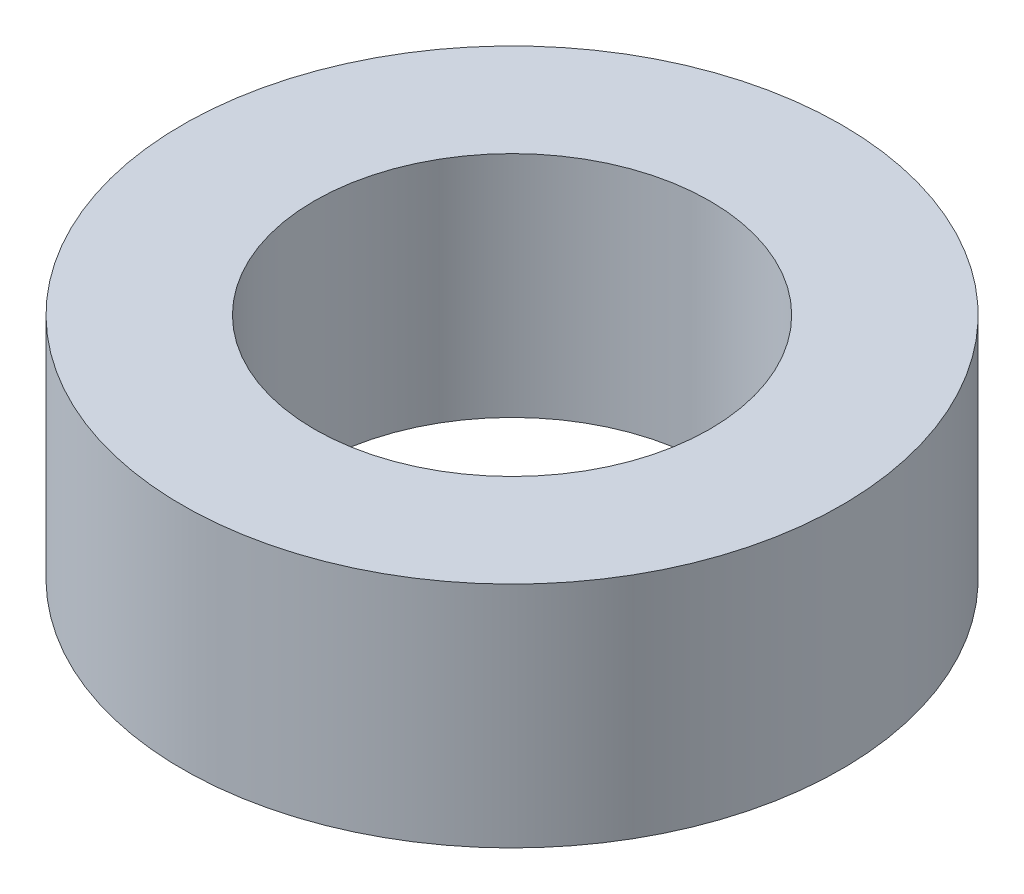
ISO-10303-21;
HEADER;
FILE_DESCRIPTION(('STEP AP214'),'2;1');
FILE_NAME('part.step','',(''),(''),'','','');
FILE_SCHEMA(('AUTOMOTIVE_DESIGN { 1 0 10303 214 1 1 1 1 }'));
ENDSEC;
DATA;
#1=APPLICATION_CONTEXT('core data for automotive mechanical design processes');
#2=APPLICATION_PROTOCOL_DEFINITION('international standard','automotive_design',2000,#1);
#3=PRODUCT_CONTEXT('',#1,'mechanical');
#4=PRODUCT('Part','Part','',(#3));
#5=PRODUCT_RELATED_PRODUCT_CATEGORY('part','',(#4));
#6=PRODUCT_DEFINITION_FORMATION('','',#4);
#7=PRODUCT_DEFINITION_CONTEXT('part definition',#1,'design');
#8=PRODUCT_DEFINITION('design','',#6,#7);
#9=PRODUCT_DEFINITION_SHAPE('','',#8);
#10=(LENGTH_UNIT() NAMED_UNIT(*) SI_UNIT(.MILLI.,.METRE.));
#11=(NAMED_UNIT(*) PLANE_ANGLE_UNIT() SI_UNIT($,.RADIAN.));
#12=(NAMED_UNIT(*) SI_UNIT($,.STERADIAN.) SOLID_ANGLE_UNIT());
#13=UNCERTAINTY_MEASURE_WITH_UNIT(LENGTH_MEASURE(1.E-05),#10,'distance_accuracy_value','');
#14=(GEOMETRIC_REPRESENTATION_CONTEXT(3) GLOBAL_UNCERTAINTY_ASSIGNED_CONTEXT((#13)) GLOBAL_UNIT_ASSIGNED_CONTEXT((#10,
#11,#12)) REPRESENTATION_CONTEXT('',''));
#15=CARTESIAN_POINT('',(0.,0.,0.));
#16=DIRECTION('',(0.,0.,1.));
#17=DIRECTION('',(1.,0.,0.));
#18=AXIS2_PLACEMENT_3D('',#15,#16,#17);
#19=CARTESIAN_POINT('',(0.,26.,0.));
#20=DIRECTION('',(0.,-1.,0.));
#21=DIRECTION('',(0.,0.,-1.));
#22=AXIS2_PLACEMENT_3D('',#19,#20,#21);
#23=CYLINDRICAL_SURFACE('',#22,37.5);
#24=CARTESIAN_POINT('',(0.,26.,0.));
#25=DIRECTION('',(0.,1.,0.));
#26=DIRECTION('',(0.,0.,1.));
#27=AXIS2_PLACEMENT_3D('',#24,#25,#26);
#28=CIRCLE('',#27,37.5);
#29=CARTESIAN_POINT('',(0.,26.,-37.5));
#30=VERTEX_POINT('',#29);
#31=EDGE_CURVE('E10',#30,#30,#28,.T.);
#32=CARTESIAN_POINT('',(0.,0.,0.));
#33=DIRECTION('',(0.,1.,0.));
#34=DIRECTION('',(0.,0.,1.));
#35=AXIS2_PLACEMENT_3D('',#32,#33,#34);
#36=CIRCLE('',#35,37.5);
#37=CARTESIAN_POINT('',(0.,0.,-37.5));
#38=VERTEX_POINT('',#37);
#39=EDGE_CURVE('E37',#38,#38,#36,.T.);
#40=CARTESIAN_POINT('',(0.,26.,-37.5));
#41=CARTESIAN_POINT('',(0.,25.7291666666667,-37.5));
#42=CARTESIAN_POINT('',(0.,25.4583333333333,-37.5));
#43=CARTESIAN_POINT('',(0.,24.9166666666667,-37.5));
#44=CARTESIAN_POINT('',(0.,24.6458333333333,-37.5));
#45=CARTESIAN_POINT('',(0.,24.1041666666667,-37.5));
#46=CARTESIAN_POINT('',(0.,23.8333333333333,-37.5));
#47=CARTESIAN_POINT('',(0.,23.2916666666667,-37.5));
#48=CARTESIAN_POINT('',(0.,23.0208333333333,-37.5));
#49=CARTESIAN_POINT('',(0.,22.4791666666667,-37.5));
#50=CARTESIAN_POINT('',(0.,22.2083333333333,-37.5));
#51=CARTESIAN_POINT('',(0.,21.6666666666667,-37.5));
#52=CARTESIAN_POINT('',(0.,21.3958333333333,-37.5));
#53=CARTESIAN_POINT('',(0.,20.8541666666667,-37.5));
#54=CARTESIAN_POINT('',(0.,20.5833333333333,-37.5));
#55=CARTESIAN_POINT('',(0.,20.0416666666667,-37.5));
#56=CARTESIAN_POINT('',(0.,19.7708333333333,-37.5));
#57=CARTESIAN_POINT('',(0.,19.2291666666667,-37.5));
#58=CARTESIAN_POINT('',(0.,18.9583333333333,-37.5));
#59=CARTESIAN_POINT('',(0.,18.4166666666667,-37.5));
#60=CARTESIAN_POINT('',(0.,18.1458333333333,-37.5));
#61=CARTESIAN_POINT('',(0.,17.6041666666667,-37.5));
#62=CARTESIAN_POINT('',(0.,17.3333333333333,-37.5));
#63=CARTESIAN_POINT('',(0.,16.7916666666667,-37.5));
#64=CARTESIAN_POINT('',(0.,16.5208333333333,-37.5));
#65=CARTESIAN_POINT('',(0.,15.9791666666667,-37.5));
#66=CARTESIAN_POINT('',(0.,15.7083333333333,-37.5));
#67=CARTESIAN_POINT('',(0.,15.1666666666667,-37.5));
#68=CARTESIAN_POINT('',(0.,14.8958333333333,-37.5));
#69=CARTESIAN_POINT('',(0.,14.3541666666667,-37.5));
#70=CARTESIAN_POINT('',(0.,14.0833333333333,-37.5));
#71=CARTESIAN_POINT('',(0.,13.5416666666667,-37.5));
#72=CARTESIAN_POINT('',(0.,13.2708333333333,-37.5));
#73=CARTESIAN_POINT('',(0.,12.7291666666667,-37.5));
#74=CARTESIAN_POINT('',(0.,12.4583333333333,-37.5));
#75=CARTESIAN_POINT('',(0.,11.9166666666667,-37.5));
#76=CARTESIAN_POINT('',(0.,11.6458333333333,-37.5));
#77=CARTESIAN_POINT('',(0.,11.1041666666667,-37.5));
#78=CARTESIAN_POINT('',(0.,10.8333333333333,-37.5));
#79=CARTESIAN_POINT('',(0.,10.2916666666667,-37.5));
#80=CARTESIAN_POINT('',(0.,10.0208333333333,-37.5));
#81=CARTESIAN_POINT('',(0.,9.47916666666667,-37.5));
#82=CARTESIAN_POINT('',(0.,9.20833333333333,-37.5));
#83=CARTESIAN_POINT('',(0.,8.66666666666667,-37.5));
#84=CARTESIAN_POINT('',(0.,8.39583333333333,-37.5));
#85=CARTESIAN_POINT('',(0.,7.85416666666667,-37.5));
#86=CARTESIAN_POINT('',(0.,7.58333333333333,-37.5));
#87=CARTESIAN_POINT('',(0.,7.04166666666667,-37.5));
#88=CARTESIAN_POINT('',(0.,6.77083333333333,-37.5));
#89=CARTESIAN_POINT('',(0.,6.22916666666667,-37.5));
#90=CARTESIAN_POINT('',(0.,5.95833333333333,-37.5));
#91=CARTESIAN_POINT('',(0.,5.41666666666667,-37.5));
#92=CARTESIAN_POINT('',(0.,5.14583333333333,-37.5));
#93=CARTESIAN_POINT('',(0.,4.60416666666667,-37.5));
#94=CARTESIAN_POINT('',(0.,4.33333333333333,-37.5));
#95=CARTESIAN_POINT('',(0.,3.79166666666667,-37.5));
#96=CARTESIAN_POINT('',(0.,3.52083333333333,-37.5));
#97=CARTESIAN_POINT('',(0.,2.97916666666667,-37.5));
#98=CARTESIAN_POINT('',(0.,2.70833333333333,-37.5));
#99=CARTESIAN_POINT('',(0.,2.16666666666667,-37.5));
#100=CARTESIAN_POINT('',(0.,1.89583333333333,-37.5));
#101=CARTESIAN_POINT('',(0.,1.35416666666667,-37.5));
#102=CARTESIAN_POINT('',(0.,1.08333333333333,-37.5));
#103=CARTESIAN_POINT('',(0.,0.541666666666667,-37.5));
#104=CARTESIAN_POINT('',(0.,0.270833333333334,-37.5));
#105=CARTESIAN_POINT('',(0.,0.,-37.5));
#106=B_SPLINE_CURVE_WITH_KNOTS('',3,(#40,#41,#42,#43,#44,#45,#46,#47,#48,#49,#50,#51,#52,#53,
#54,#55,#56,#57,#58,#59,#60,#61,#62,#63,#64,#65,#66,#67,#68,#69,#70,#71,#72,#73,#74,#75,#76,#77,
#78,#79,#80,#81,#82,#83,#84,#85,#86,#87,#88,#89,#90,#91,#92,#93,#94,#95,#96,#97,#98,#99,#100,
#101,#102,#103,#104,#105),.UNSPECIFIED.,.F.,.F.,(4,2,2,2,2,2,2,2,2,2,2,2,2,2,2,2,2,2,2,2,2,2,2,
2,2,2,2,2,2,2,2,2,4),(0.,0.812499999999997,1.625,2.4375,3.25,4.0625,4.875,5.6875,6.5,7.3125,
8.125,8.93749999999999,9.74999999999999,10.5625,11.375,12.1875,13.,13.8125,14.625,15.4375,16.25,
17.0625,17.875,18.6875,19.5,20.3125,21.125,21.9375,22.75,23.5625,24.375,25.1875,26.),.UNSPECIFIED.);
#107=EDGE_CURVE('BSEAM40',#30,#38,#106,.T.);
#108=ORIENTED_EDGE('',*,*,#31,.F.);
#109=ORIENTED_EDGE('',*,*,#39,.T.);
#110=ORIENTED_EDGE('',*,*,#107,.T.);
#111=ORIENTED_EDGE('',*,*,#107,.F.);
#112=EDGE_LOOP('',(#108,#110,#109,#111));
#113=FACE_BOUND('',#112,.T.);
#114=ADVANCED_FACE('F40',(#113),#23,.T.);
#115=CARTESIAN_POINT('',(0.,26.,0.));
#116=DIRECTION('',(0.,1.,0.));
#117=DIRECTION('',(0.,0.,1.));
#118=AXIS2_PLACEMENT_3D('',#115,#116,#117);
#119=PLANE('',#118);
#120=CARTESIAN_POINT('',(0.,26.,0.));
#121=DIRECTION('',(0.,1.,0.));
#122=DIRECTION('',(0.,0.,1.));
#123=AXIS2_PLACEMENT_3D('',#120,#121,#122);
#124=CIRCLE('',#123,22.5);
#125=CARTESIAN_POINT('',(0.,26.,-22.5));
#126=VERTEX_POINT('',#125);
#127=EDGE_CURVE('E50',#126,#126,#124,.T.);
#128=ORIENTED_EDGE('',*,*,#127,.F.);
#129=EDGE_LOOP('',(#128));
#130=FACE_BOUND('',#129,.T.);
#131=ORIENTED_EDGE('',*,*,#31,.T.);
#132=EDGE_LOOP('',(#131));
#133=FACE_BOUND('',#132,.T.);
#134=ADVANCED_FACE('F59',(#130,#133),#119,.T.);
#135=CARTESIAN_POINT('',(0.,0.,0.));
#136=DIRECTION('',(0.,1.,0.));
#137=DIRECTION('',(0.,0.,1.));
#138=AXIS2_PLACEMENT_3D('',#135,#136,#137);
#139=PLANE('',#138);
#140=CARTESIAN_POINT('',(0.,0.,0.));
#141=DIRECTION('',(0.,1.,0.));
#142=DIRECTION('',(0.,0.,1.));
#143=AXIS2_PLACEMENT_3D('',#140,#141,#142);
#144=CIRCLE('',#143,22.5);
#145=CARTESIAN_POINT('',(0.,0.,-22.5));
#146=VERTEX_POINT('',#145);
#147=EDGE_CURVE('E47',#146,#146,#144,.T.);
#148=ORIENTED_EDGE('',*,*,#147,.T.);
#149=EDGE_LOOP('',(#148));
#150=FACE_BOUND('',#149,.T.);
#151=ORIENTED_EDGE('',*,*,#39,.F.);
#152=EDGE_LOOP('',(#151));
#153=FACE_BOUND('',#152,.T.);
#154=ADVANCED_FACE('F58',(#150,#153),#139,.F.);
#155=CARTESIAN_POINT('',(0.,26.,0.));
#156=DIRECTION('',(0.,-1.,0.));
#157=DIRECTION('',(0.,0.,-1.));
#158=AXIS2_PLACEMENT_3D('',#155,#156,#157);
#159=CYLINDRICAL_SURFACE('',#158,22.5);
#160=CARTESIAN_POINT('',(0.,26.,-22.5));
#161=CARTESIAN_POINT('',(0.,25.7291666666667,-22.5));
#162=CARTESIAN_POINT('',(0.,25.4583333333333,-22.5));
#163=CARTESIAN_POINT('',(0.,24.9166666666667,-22.5));
#164=CARTESIAN_POINT('',(0.,24.6458333333333,-22.5));
#165=CARTESIAN_POINT('',(0.,24.1041666666667,-22.5));
#166=CARTESIAN_POINT('',(0.,23.8333333333333,-22.5));
#167=CARTESIAN_POINT('',(0.,23.2916666666667,-22.5));
#168=CARTESIAN_POINT('',(0.,23.0208333333333,-22.5));
#169=CARTESIAN_POINT('',(0.,22.4791666666667,-22.5));
#170=CARTESIAN_POINT('',(0.,22.2083333333333,-22.5));
#171=CARTESIAN_POINT('',(0.,21.6666666666667,-22.5));
#172=CARTESIAN_POINT('',(0.,21.3958333333333,-22.5));
#173=CARTESIAN_POINT('',(0.,20.8541666666667,-22.5));
#174=CARTESIAN_POINT('',(0.,20.5833333333333,-22.5));
#175=CARTESIAN_POINT('',(0.,20.0416666666667,-22.5));
#176=CARTESIAN_POINT('',(0.,19.7708333333333,-22.5));
#177=CARTESIAN_POINT('',(0.,19.2291666666667,-22.5));
#178=CARTESIAN_POINT('',(0.,18.9583333333333,-22.5));
#179=CARTESIAN_POINT('',(0.,18.4166666666667,-22.5));
#180=CARTESIAN_POINT('',(0.,18.1458333333333,-22.5));
#181=CARTESIAN_POINT('',(0.,17.6041666666667,-22.5));
#182=CARTESIAN_POINT('',(0.,17.3333333333333,-22.5));
#183=CARTESIAN_POINT('',(0.,16.7916666666667,-22.5));
#184=CARTESIAN_POINT('',(0.,16.5208333333333,-22.5));
#185=CARTESIAN_POINT('',(0.,15.9791666666667,-22.5));
#186=CARTESIAN_POINT('',(0.,15.7083333333333,-22.5));
#187=CARTESIAN_POINT('',(0.,15.1666666666667,-22.5));
#188=CARTESIAN_POINT('',(0.,14.8958333333333,-22.5));
#189=CARTESIAN_POINT('',(0.,14.3541666666667,-22.5));
#190=CARTESIAN_POINT('',(0.,14.0833333333333,-22.5));
#191=CARTESIAN_POINT('',(0.,13.5416666666667,-22.5));
#192=CARTESIAN_POINT('',(0.,13.2708333333333,-22.5));
#193=CARTESIAN_POINT('',(0.,12.7291666666667,-22.5));
#194=CARTESIAN_POINT('',(0.,12.4583333333333,-22.5));
#195=CARTESIAN_POINT('',(0.,11.9166666666667,-22.5));
#196=CARTESIAN_POINT('',(0.,11.6458333333333,-22.5));
#197=CARTESIAN_POINT('',(0.,11.1041666666667,-22.5));
#198=CARTESIAN_POINT('',(0.,10.8333333333333,-22.5));
#199=CARTESIAN_POINT('',(0.,10.2916666666667,-22.5));
#200=CARTESIAN_POINT('',(0.,10.0208333333333,-22.5));
#201=CARTESIAN_POINT('',(0.,9.47916666666667,-22.5));
#202=CARTESIAN_POINT('',(0.,9.20833333333333,-22.5));
#203=CARTESIAN_POINT('',(0.,8.66666666666667,-22.5));
#204=CARTESIAN_POINT('',(0.,8.39583333333333,-22.5));
#205=CARTESIAN_POINT('',(0.,7.85416666666667,-22.5));
#206=CARTESIAN_POINT('',(0.,7.58333333333333,-22.5));
#207=CARTESIAN_POINT('',(0.,7.04166666666667,-22.5));
#208=CARTESIAN_POINT('',(0.,6.77083333333333,-22.5));
#209=CARTESIAN_POINT('',(0.,6.22916666666667,-22.5));
#210=CARTESIAN_POINT('',(0.,5.95833333333333,-22.5));
#211=CARTESIAN_POINT('',(0.,5.41666666666667,-22.5));
#212=CARTESIAN_POINT('',(0.,5.14583333333333,-22.5));
#213=CARTESIAN_POINT('',(0.,4.60416666666667,-22.5));
#214=CARTESIAN_POINT('',(0.,4.33333333333333,-22.5));
#215=CARTESIAN_POINT('',(0.,3.79166666666667,-22.5));
#216=CARTESIAN_POINT('',(0.,3.52083333333333,-22.5));
#217=CARTESIAN_POINT('',(0.,2.97916666666667,-22.5));
#218=CARTESIAN_POINT('',(0.,2.70833333333333,-22.5));
#219=CARTESIAN_POINT('',(0.,2.16666666666667,-22.5));
#220=CARTESIAN_POINT('',(0.,1.89583333333333,-22.5));
#221=CARTESIAN_POINT('',(0.,1.35416666666667,-22.5));
#222=CARTESIAN_POINT('',(0.,1.08333333333333,-22.5));
#223=CARTESIAN_POINT('',(0.,0.541666666666667,-22.5));
#224=CARTESIAN_POINT('',(0.,0.270833333333334,-22.5));
#225=CARTESIAN_POINT('',(0.,0.,-22.5));
#226=B_SPLINE_CURVE_WITH_KNOTS('',3,(#160,#161,#162,#163,#164,#165,#166,#167,#168,#169,#170,
#171,#172,#173,#174,#175,#176,#177,#178,#179,#180,#181,#182,#183,#184,#185,#186,#187,#188,#189,
#190,#191,#192,#193,#194,#195,#196,#197,#198,#199,#200,#201,#202,#203,#204,#205,#206,#207,#208,
#209,#210,#211,#212,#213,#214,#215,#216,#217,#218,#219,#220,#221,#222,#223,#224,#225),
.UNSPECIFIED.,.F.,.F.,(4,2,2,2,2,2,2,2,2,2,2,2,2,2,2,2,2,2,2,2,2,2,2,2,2,2,2,2,2,2,2,2,4),(0.,
0.812499999999997,1.625,2.4375,3.25,4.0625,4.875,5.6875,6.5,7.3125,8.125,8.93749999999999,
9.74999999999999,10.5625,11.375,12.1875,13.,13.8125,14.625,15.4375,16.25,17.0625,17.875,18.6875,
19.5,20.3125,21.125,21.9375,22.75,23.5625,24.375,25.1875,26.),.UNSPECIFIED.);
#227=EDGE_CURVE('BSEAM54',#126,#146,#226,.T.);
#228=ORIENTED_EDGE('',*,*,#127,.T.);
#229=ORIENTED_EDGE('',*,*,#147,.F.);
#230=ORIENTED_EDGE('',*,*,#227,.T.);
#231=ORIENTED_EDGE('',*,*,#227,.F.);
#232=EDGE_LOOP('',(#228,#230,#229,#231));
#233=FACE_BOUND('',#232,.T.);
#234=ADVANCED_FACE('F54',(#233),#159,.F.);
#235=CLOSED_SHELL('',(#114,#134,#154,#234));
#236=MANIFOLD_SOLID_BREP('B2',#235);
#237=ADVANCED_BREP_SHAPE_REPRESENTATION('',(#18,#236),#14);
#238=SHAPE_DEFINITION_REPRESENTATION(#9,#237);
ENDSEC;
END-ISO-10303-21;
